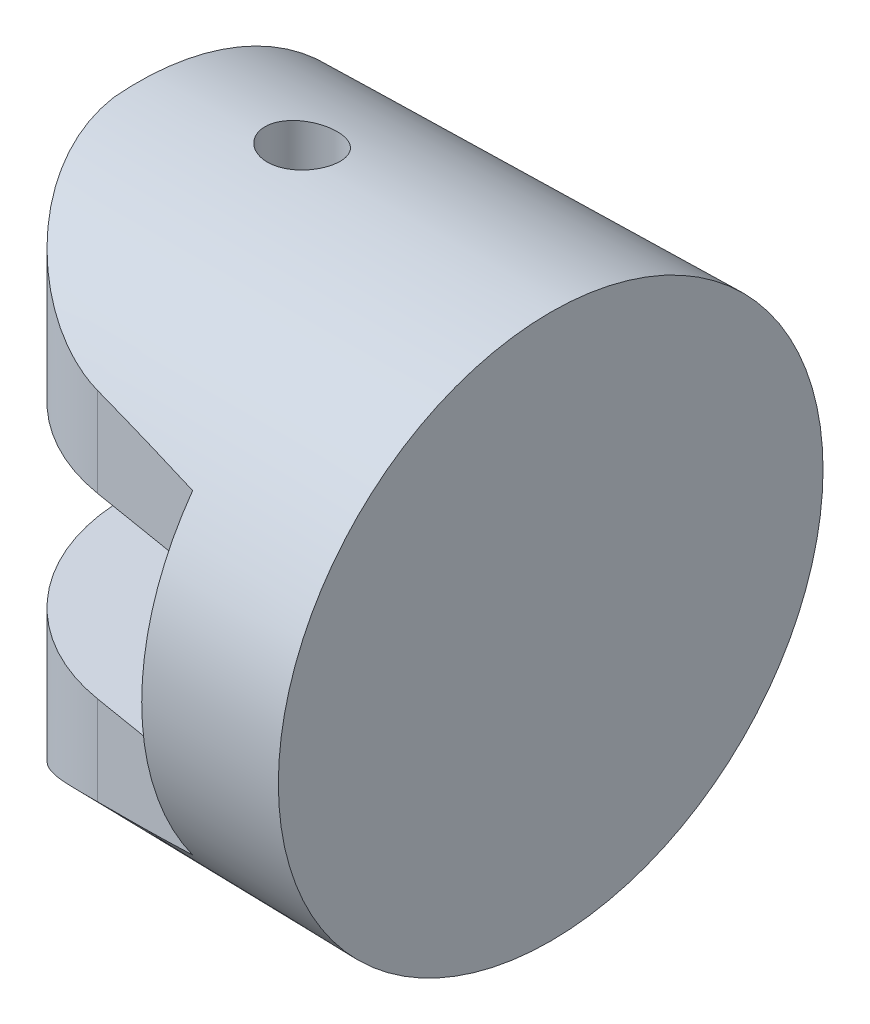
ISO-10303-21;
HEADER;
FILE_DESCRIPTION(('STEP AP214'),'2;1');
FILE_NAME('part.step','',(''),(''),'','','');
FILE_SCHEMA(('AUTOMOTIVE_DESIGN { 1 0 10303 214 1 1 1 1 }'));
ENDSEC;
DATA;
#1=APPLICATION_CONTEXT('core data for automotive mechanical design processes');
#2=APPLICATION_PROTOCOL_DEFINITION('international standard','automotive_design',2000,#1);
#3=PRODUCT_CONTEXT('',#1,'mechanical');
#4=PRODUCT('Part','Part','',(#3));
#5=PRODUCT_RELATED_PRODUCT_CATEGORY('part','',(#4));
#6=PRODUCT_DEFINITION_FORMATION('','',#4);
#7=PRODUCT_DEFINITION_CONTEXT('part definition',#1,'design');
#8=PRODUCT_DEFINITION('design','',#6,#7);
#9=PRODUCT_DEFINITION_SHAPE('','',#8);
#10=(LENGTH_UNIT() NAMED_UNIT(*) SI_UNIT(.MILLI.,.METRE.));
#11=(NAMED_UNIT(*) PLANE_ANGLE_UNIT() SI_UNIT($,.RADIAN.));
#12=(NAMED_UNIT(*) SI_UNIT($,.STERADIAN.) SOLID_ANGLE_UNIT());
#13=UNCERTAINTY_MEASURE_WITH_UNIT(LENGTH_MEASURE(1.E-05),#10,'distance_accuracy_value','');
#14=(GEOMETRIC_REPRESENTATION_CONTEXT(3) GLOBAL_UNCERTAINTY_ASSIGNED_CONTEXT((#13)) GLOBAL_UNIT_ASSIGNED_CONTEXT((#10,
#11,#12)) REPRESENTATION_CONTEXT('',''));
#15=CARTESIAN_POINT('',(0.,0.,0.));
#16=DIRECTION('',(0.,0.,1.));
#17=DIRECTION('',(1.,0.,0.));
#18=AXIS2_PLACEMENT_3D('',#15,#16,#17);
#19=CARTESIAN_POINT('',(18.,0.,0.));
#20=DIRECTION('',(1.,0.,0.));
#21=DIRECTION('',(0.,0.,-1.));
#22=AXIS2_PLACEMENT_3D('',#19,#20,#21);
#23=CONICAL_SURFACE('',#22,10.,0.0174532925199433);
#24=CARTESIAN_POINT('',(11.0177651568953,0.,0.));
#25=DIRECTION('',(1.,0.,0.));
#26=DIRECTION('',(0.,0.,-1.));
#27=AXIS2_PLACEMENT_3D('',#24,#25,#26);
#28=CIRCLE('',#27,9.87812463746955);
#29=CARTESIAN_POINT('',(11.0177651568953,-3.92878497820579,-9.06322210631558));
#30=VERTEX_POINT('',#29);
#31=CARTESIAN_POINT('',(11.0177651568953,3.92878497820579,-9.06322210631558));
#32=VERTEX_POINT('',#31);
#33=EDGE_CURVE('E271',#30,#32,#28,.T.);
#34=ORIENTED_EDGE('',*,*,#33,.T.);
#35=CARTESIAN_POINT('',(20.2969723303004,4.31989451118412,-9.06322210631558));
#36=CARTESIAN_POINT('',(18.7080885564402,4.25543102840023,-9.06322210631558));
#37=CARTESIAN_POINT('',(17.1192523911536,4.18980862170796,-9.06322210631558));
#38=CARTESIAN_POINT('',(13.9416943097065,4.05585646983265,-9.06322210631558));
#39=CARTESIAN_POINT('',(12.3529723935455,3.98752672466418,-9.06322210631558));
#40=CARTESIAN_POINT('',(7.58713330280682,3.77789782009088,-9.06322210631558));
#41=CARTESIAN_POINT('',(4.4102160029855,3.6319539101051,-9.06322210631558));
#42=CARTESIAN_POINT('',(-0.354564542941831,3.39973561718179,-9.06322210631558));
#43=CARTESIAN_POINT('',(-1.94275188567311,3.32011101408796,-9.06322210631558));
#44=CARTESIAN_POINT('',(-5.11883447902559,3.15532531464605,-9.06322210631558));
#45=CARTESIAN_POINT('',(-6.70672973075484,3.07016423975371,-9.06322210631558));
#46=CARTESIAN_POINT('',(-9.88219304506763,2.89279787770695,-9.06322210631558));
#47=CARTESIAN_POINT('',(-11.4697610924561,2.80059231565376,-9.06322210631558));
#48=CARTESIAN_POINT('',(-13.8506918956231,2.65520693731331,-9.06322210631558));
#49=CARTESIAN_POINT('',(-14.6442704742863,2.60556529083735,-9.06322210631558));
#50=CARTESIAN_POINT('',(-16.2312477290328,2.50344514246502,-9.06322210631558));
#51=CARTESIAN_POINT('',(-17.0246464044434,2.45096663013025,-9.06322210631558));
#52=CARTESIAN_POINT('',(-17.8179341999841,2.39683086826783,-9.06322210631558));
#53=B_SPLINE_CURVE_WITH_KNOTS('',3,(#35,#36,#37,#38,#39,#40,#41,#42,#43,#44,#45,#46,#47,#48,#49,
#50,#51,#52),.UNSPECIFIED.,.F.,.F.,(4,2,2,2,2,2,2,2,4),(0.,4.77057082371856,9.54114162178145,
19.0819025653042,23.8524416364401,28.6229622212003,33.3936690623478,35.7790536857637,
38.1644470869158),.UNSPECIFIED.);
#54=CARTESIAN_POINT('',(0.500000000000001,3.44122657780387,-9.06322210631558));
#55=VERTEX_POINT('',#54);
#56=EDGE_CURVE('E66',#32,#55,#53,.T.);
#57=ORIENTED_EDGE('',*,*,#56,.T.);
#58=CARTESIAN_POINT('',(0.5,3.44122657780387,-9.06322210631558));
#59=CARTESIAN_POINT('',(0.488972489827907,3.44064910843317,-9.06323484747074));
#60=CARTESIAN_POINT('',(0.477931357303025,3.44110061300837,-9.06285786392514));
#61=CARTESIAN_POINT('',(0.4562618936079,3.4438246103192,-9.06141879058935));
#62=CARTESIAN_POINT('',(0.445630070497123,3.4460734774454,-9.06036562404899));
#63=CARTESIAN_POINT('',(0.422602189733876,3.45283171405578,-9.05736225179888));
#64=CARTESIAN_POINT('',(0.410343513345188,3.45773422337728,-9.05526407978749));
#65=CARTESIAN_POINT('',(0.386805071862961,3.46932512198919,-9.05038966538554));
#66=CARTESIAN_POINT('',(0.37553073314102,3.47602267243875,-9.04760995106007));
#67=CARTESIAN_POINT('',(0.346852053778633,3.49554320194998,-9.03955531211863));
#68=CARTESIAN_POINT('',(0.330341095440965,3.50948276595441,-9.0338481720886));
#69=CARTESIAN_POINT('',(0.299621432152494,3.53934978995462,-9.0216128697625));
#70=CARTESIAN_POINT('',(0.285418234456481,3.55528184919153,-9.01508280765378));
#71=CARTESIAN_POINT('',(0.257652543224867,3.58982368895958,-9.00086540877679));
#72=CARTESIAN_POINT('',(0.244258070011103,3.6085456605633,-8.99312679824922));
#73=CARTESIAN_POINT('',(0.21916152774292,3.64690648223025,-8.97716661282243));
#74=CARTESIAN_POINT('',(0.207461420613685,3.66654636090242,-8.96894449330291));
#75=CARTESIAN_POINT('',(0.174373351641166,3.72644937730157,-8.94367439726255));
#76=CARTESIAN_POINT('',(0.155058524103321,3.76761298909578,-8.92605654201362));
#77=CARTESIAN_POINT('',(0.117878853864184,3.85737016724907,-8.88696828495656));
#78=CARTESIAN_POINT('',(0.10067257913814,3.90614761858275,-8.86531769684839));
#79=CARTESIAN_POINT('',(0.0705793900740989,4.00450698464848,-8.82074843971116));
#80=CARTESIAN_POINT('',(0.0576976521769212,4.05408978951802,-8.79782828896725));
#81=CARTESIAN_POINT('',(0.0358429898819124,4.15350740429995,-8.75090899216327));
#82=CARTESIAN_POINT('',(0.0268647491596888,4.20334177736191,-8.72691136305049));
#83=CARTESIAN_POINT('',(0.012662204405409,4.30304639931846,-8.6779058509269));
#84=CARTESIAN_POINT('',(0.00743735214440568,4.35291664190827,-8.6528981160184));
#85=CARTESIAN_POINT('',(0.00277353438660693,4.423322702343,-8.61687795639255));
#86=CARTESIAN_POINT('',(0.00173790354349333,4.44395201825318,-8.60623670335064));
#87=CARTESIAN_POINT('',(0.00035213860226231,4.48511862421795,-8.58482730544618));
#88=CARTESIAN_POINT('',(7.25974744487177E-07,4.50565601422816,-8.57405943514926));
#89=CARTESIAN_POINT('',(0.,4.5261595060541,-8.56322210631558));
#90=B_SPLINE_CURVE_WITH_KNOTS('',3,(#58,#59,#60,#61,#62,#63,#64,#65,#66,#67,#68,#69,#70,#71,#72,
#73,#74,#75,#76,#77,#78,#79,#80,#81,#82,#83,#84,#85,#86,#87,#88,#89),.UNSPECIFIED.,.F.,.F.,(4,2,
2,2,2,2,2,2,2,2,2,2,2,2,2,4),(0.,0.0330153300110685,0.0656036862743701,0.105482124639468,
0.145568095171378,0.21223889679795,0.279066536662061,0.35181001144263,0.424637054519927,
0.57061327174187,0.738616317391868,0.906819750414755,1.07479337751626,1.2427424649945,
1.31243961919626,1.38200641190874),.UNSPECIFIED.);
#91=CARTESIAN_POINT('',(0.,4.5261595060541,-8.56322210631558));
#92=VERTEX_POINT('',#91);
#93=EDGE_CURVE('E238',#55,#92,#90,.T.);
#94=ORIENTED_EDGE('',*,*,#93,.T.);
#95=CARTESIAN_POINT('',(0.,0.,0.));
#96=DIRECTION('',(1.,0.,0.));
#97=DIRECTION('',(0.,0.,-1.));
#98=AXIS2_PLACEMENT_3D('',#95,#96,#97);
#99=CIRCLE('',#98,9.68580883129208);
#100=CARTESIAN_POINT('',(0.,9.64535449468622,0.884324255107802));
#101=VERTEX_POINT('',#100);
#102=EDGE_CURVE('E304',#92,#101,#99,.T.);
#103=ORIENTED_EDGE('',*,*,#102,.T.);
#104=CARTESIAN_POINT('',(-1.36975409478247E-05,9.64537258929262,0.884124255107814));
#105=CARTESIAN_POINT('',(0.0123868923697063,9.62898345502771,1.0657605480332));
#106=CARTESIAN_POINT('',(0.0319097094958452,9.6075541672637,1.24640129617914));
#107=CARTESIAN_POINT('',(0.0845881608132044,9.55524357914047,1.60413224665397));
#108=CARTESIAN_POINT('',(0.117731425064306,9.52437086168804,1.78122551811));
#109=CARTESIAN_POINT('',(0.196770459181363,9.45403081721556,2.12934455143109));
#110=CARTESIAN_POINT('',(0.242570125942704,9.41462872596965,2.3004054943183));
#111=CARTESIAN_POINT('',(0.346287823946465,9.32789684979715,2.63676332814577));
#112=CARTESIAN_POINT('',(0.404208193858568,9.28056553529206,2.80205909951436));
#113=CARTESIAN_POINT('',(0.531139407846054,9.17906407232717,3.12537340116261));
#114=CARTESIAN_POINT('',(0.600107850186022,9.124920233813,3.28341689555175));
#115=CARTESIAN_POINT('',(0.748521366783366,9.0106000413984,3.59226932860706));
#116=CARTESIAN_POINT('',(0.827970498318087,8.95042135346575,3.74307543454829));
#117=CARTESIAN_POINT('',(1.08114581746759,8.76213953492645,4.18424721990012));
#118=CARTESIAN_POINT('',(1.26957479609656,8.62639216554954,4.46305274627942));
#119=CARTESIAN_POINT('',(1.70599105772172,8.32510973623837,5.01969391646392));
#120=CARTESIAN_POINT('',(1.95846577192259,8.15796809899323,5.2931251913958));
#121=CARTESIAN_POINT('',(2.36612117644174,7.90494604271217,5.67023362747837));
#122=CARTESIAN_POINT('',(2.50697950417843,7.82013782119801,5.79052968044107));
#123=CARTESIAN_POINT('',(2.79812127913359,7.651491295814,6.01982577214195));
#124=CARTESIAN_POINT('',(2.94840138096449,7.56765266005769,6.12882978428737));
#125=CARTESIAN_POINT('',(3.24251970729209,7.41124406850702,6.3247154473614));
#126=CARTESIAN_POINT('',(3.38546014785115,7.33839488440852,6.41271952841057));
#127=CARTESIAN_POINT('',(3.67875378713234,7.19668152216184,6.57895529352384));
#128=CARTESIAN_POINT('',(3.82910794964942,7.12781786468103,6.65718570229969));
#129=CARTESIAN_POINT('',(4.29016397688817,6.93047449281161,6.87589081226343));
#130=CARTESIAN_POINT('',(4.61227358236053,6.81045383364741,7.00133102900793));
#131=CARTESIAN_POINT('',(5.09174236835255,6.66836677207874,7.14711198266969));
#132=CARTESIAN_POINT('',(5.23851371880068,6.62943088747617,7.18663340659563));
#133=CARTESIAN_POINT('',(5.53671146625283,6.56066036848477,7.25647405178247));
#134=CARTESIAN_POINT('',(5.68814874719265,6.53084911918732,7.28676962756826));
#135=CARTESIAN_POINT('',(5.84145886876603,6.50641172742482,7.31211903025766));
#136=B_SPLINE_CURVE_WITH_KNOTS('',3,(#104,#105,#106,#107,#108,#109,#110,#111,#112,#113,#114,
#115,#116,#117,#118,#119,#120,#121,#122,#123,#124,#125,#126,#127,#128,#129,#130,#131,#132,#133,
#134,#135),.UNSPECIFIED.,.F.,.F.,(4,2,2,2,2,2,2,2,2,2,2,2,2,2,2,4),(0.,0.548099498363084,
1.0957023150084,1.6392561938557,2.18291504738781,2.72453527682406,3.26636579661093,
4.35107355933018,5.57024159975679,6.18100046028574,6.79154367367793,7.34003028043755,
7.88858838024264,8.98011661667429,9.45032579876322,9.92173015747335),.UNSPECIFIED.);
#137=CARTESIAN_POINT('',(5.84125886876603,6.50644365183281,7.31208595043073));
#138=VERTEX_POINT('',#137);
#139=EDGE_CURVE('E228',#101,#138,#136,.T.);
#140=ORIENTED_EDGE('',*,*,#139,.T.);
#141=CARTESIAN_POINT('',(-32.5469915710701,0.,0.962131485217023));
#142=DIRECTION('',(-0.163196404380119,0.,0.986593601032056));
#143=DIRECTION('',(0.986593601032056,0.,0.163196404380119));
#144=AXIS2_PLACEMENT_3D('',#141,#142,#143);
#145=ELLIPSE('',#144,55.8694844707714,9.06679313201254);
#146=CARTESIAN_POINT('',(10.,5.76425963035589,8.));
#147=VERTEX_POINT('',#146);
#148=EDGE_CURVE('E298',#147,#138,#145,.T.);
#149=ORIENTED_EDGE('',*,*,#148,.F.);
#150=CARTESIAN_POINT('',(10.,0.,0.));
#151=DIRECTION('',(1.,0.,0.));
#152=DIRECTION('',(0.,0.,-1.));
#153=AXIS2_PLACEMENT_3D('',#150,#151,#152);
#154=CIRCLE('',#153,9.86035948057426);
#155=CARTESIAN_POINT('',(10.,-5.76425963035589,8.));
#156=VERTEX_POINT('',#155);
#157=EDGE_CURVE('E290',#147,#156,#154,.T.);
#158=ORIENTED_EDGE('',*,*,#157,.T.);
#159=CARTESIAN_POINT('',(5.84125886876603,-6.50644365183283,7.31208595043073));
#160=VERTEX_POINT('',#159);
#161=EDGE_CURVE('E187',#160,#156,#145,.T.);
#162=ORIENTED_EDGE('',*,*,#161,.F.);
#163=CARTESIAN_POINT('',(5.84145886876603,-6.50641172742482,7.31211903025766));
#164=CARTESIAN_POINT('',(5.65545507837015,-6.53603876221126,7.28138107725543));
#165=CARTESIAN_POINT('',(5.47219254414434,-6.57360969084854,7.24333168314501));
#166=CARTESIAN_POINT('',(5.11271525289329,-6.66173818234046,7.15380287186));
#167=CARTESIAN_POINT('',(4.93648237925481,-6.71225948300966,7.10236094876064));
#168=CARTESIAN_POINT('',(4.59298202137957,-6.8231323974145,6.98752395262283));
#169=CARTESIAN_POINT('',(4.42565355972415,-6.88340120956597,6.9242289087127));
#170=CARTESIAN_POINT('',(4.09873651313887,-7.01150535897184,6.78627926691875));
#171=CARTESIAN_POINT('',(3.9391504312696,-7.07934312013544,6.71162102723833));
#172=CARTESIAN_POINT('',(3.59360092776935,-7.23585653152373,6.53400476786316));
#173=CARTESIAN_POINT('',(3.40956903497781,-7.32583099368512,6.42843535646395));
#174=CARTESIAN_POINT('',(3.0533917744159,-7.51020366867256,6.20228320734757));
#175=CARTESIAN_POINT('',(2.88124643149187,-7.60460189074485,6.08170043824959));
#176=CARTESIAN_POINT('',(2.54816965404073,-7.7954115890666,5.82543463440269));
#177=CARTESIAN_POINT('',(2.38729735029819,-7.89183066792734,5.68968045022658));
#178=CARTESIAN_POINT('',(2.07810223885349,-8.08368471916481,5.40393711809305));
#179=CARTESIAN_POINT('',(1.92977901048627,-8.17911972443501,5.25394844765625));
#180=CARTESIAN_POINT('',(1.6451337013013,-8.36751707462208,4.9386895136001));
#181=CARTESIAN_POINT('',(1.50892595221698,-8.46045105334288,4.7732987889067));
#182=CARTESIAN_POINT('',(1.25096355230605,-8.64075431087674,4.42871649421447));
#183=CARTESIAN_POINT('',(1.12920994624197,-8.72812318722635,4.24952392814385));
#184=CARTESIAN_POINT('',(0.902062226783428,-8.8946832665904,3.87889544043039));
#185=CARTESIAN_POINT('',(0.796587571255013,-8.97391403606837,3.68752687725624));
#186=CARTESIAN_POINT('',(0.602804245557033,-9.1225833932279,3.29268150137494));
#187=CARTESIAN_POINT('',(0.51448967609839,-9.19202534384474,3.0892088813287));
#188=CARTESIAN_POINT('',(0.376602421652433,-9.30305993663332,2.72433306514314));
#189=CARTESIAN_POINT('',(0.322877887306207,-9.34725733020708,2.56527865068239));
#190=CARTESIAN_POINT('',(0.226624990050696,-9.42828686177948,2.24202965081413));
#191=CARTESIAN_POINT('',(0.184092504652002,-9.46512171049926,2.0778369830409));
#192=CARTESIAN_POINT('',(0.110539072359541,-9.53102473043131,1.74384694638878));
#193=CARTESIAN_POINT('',(0.0796178680059476,-9.56002503194743,1.57401407309212));
#194=CARTESIAN_POINT('',(0.0302756948642142,-9.60935256830463,1.23113380310959));
#195=CARTESIAN_POINT('',(0.0118669969298597,-9.62967128199486,1.05808342138005));
#196=CARTESIAN_POINT('',(-1.36975409472117E-05,-9.64537258929262,0.884124255107814));
#197=B_SPLINE_CURVE_WITH_KNOTS('',3,(#163,#164,#165,#166,#167,#168,#169,#170,#171,#172,#173,
#174,#175,#176,#177,#178,#179,#180,#181,#182,#183,#184,#185,#186,#187,#188,#189,#190,#191,#192,
#193,#194,#195,#196),.UNSPECIFIED.,.F.,.F.,(4,2,2,2,2,2,2,2,2,2,2,2,2,2,2,2,4),(0.,
0.571822725121285,1.14206146096066,1.70768868840184,2.27349757721802,2.96392081226091,
3.65434549044501,4.3481558944485,5.04194303159614,5.74170397822399,6.44151547364363,
7.1377451738392,7.83373509927868,8.35400293838512,8.87407887246403,9.39852533836108,
9.9234853829405),.UNSPECIFIED.);
#198=CARTESIAN_POINT('',(0.,-9.64535449468622,0.884324255107802));
#199=VERTEX_POINT('',#198);
#200=EDGE_CURVE('E180',#160,#199,#197,.T.);
#201=ORIENTED_EDGE('',*,*,#200,.T.);
#202=CARTESIAN_POINT('',(0.,-4.5261595060541,-8.56322210631558));
#203=VERTEX_POINT('',#202);
#204=EDGE_CURVE('E299',#199,#203,#99,.T.);
#205=ORIENTED_EDGE('',*,*,#204,.T.);
#206=CARTESIAN_POINT('',(0.,-4.5261595060541,-8.56322210631558));
#207=CARTESIAN_POINT('',(3.52078323917884E-06,-4.49689838645403,-8.57868858436406));
#208=CARTESIAN_POINT('',(0.000717079108537124,-4.46756935573359,-8.59401260241704));
#209=CARTESIAN_POINT('',(0.00351679653573565,-4.40881881293596,-8.62435454359161));
#210=CARTESIAN_POINT('',(0.0056029354608865,-4.37939730222453,-8.63937247120935));
#211=CARTESIAN_POINT('',(0.0138696466206229,-4.29083707640125,-8.68404736133356));
#212=CARTESIAN_POINT('',(0.0220578126531436,-4.23162260551151,-8.71320919509503));
#213=CARTESIAN_POINT('',(0.0437448116036034,-4.11354137842965,-8.76999160790625));
#214=CARTESIAN_POINT('',(0.0572364296467087,-4.0546742596669,-8.7976142228802));
#215=CARTESIAN_POINT('',(0.0900100035563004,-3.93785404065863,-8.85114342829085));
#216=CARTESIAN_POINT('',(0.109280408136579,-3.87989935753482,-8.87705331738044));
#217=CARTESIAN_POINT('',(0.142560653606728,-3.79726177007297,-8.9131756104814));
#218=CARTESIAN_POINT('',(0.153661919385446,-3.77175831739041,-8.9242058813395));
#219=CARTESIAN_POINT('',(0.177685950924785,-3.72131071212216,-8.94581370518517));
#220=CARTESIAN_POINT('',(0.190613674145874,-3.69636830332269,-8.95638992036121));
#221=CARTESIAN_POINT('',(0.220575416310808,-3.64417477449348,-8.97832880532304));
#222=CARTESIAN_POINT('',(0.237928427418449,-3.61706837030029,-8.98960404591289));
#223=CARTESIAN_POINT('',(0.276449756575891,-3.56523157079576,-9.01100915202635));
#224=CARTESIAN_POINT('',(0.297598452704398,-3.54048991425656,-9.02114449141271));
#225=CARTESIAN_POINT('',(0.331261397350281,-3.50910657949312,-9.03400290543964));
#226=CARTESIAN_POINT('',(0.341504986975262,-3.50040060735315,-9.03757023465756));
#227=CARTESIAN_POINT('',(0.363071607485699,-3.48417718895185,-9.04424040760721));
#228=CARTESIAN_POINT('',(0.374395716099887,-3.47666094963887,-9.04734277948617));
#229=CARTESIAN_POINT('',(0.398372513727722,-3.4632262719665,-9.05294215812881));
#230=CARTESIAN_POINT('',(0.411043654147467,-3.45733549996704,-9.05542861684756));
#231=CARTESIAN_POINT('',(0.437389825477064,-3.44804431284383,-9.05946266813466));
#232=CARTESIAN_POINT('',(0.451059356899083,-3.44463124279693,-9.06101502458788));
#233=CARTESIAN_POINT('',(0.47074321049364,-3.4419541419711,-9.06239958386088));
#234=CARTESIAN_POINT('',(0.476568496130586,-3.44143116747288,-9.0627069426259));
#235=CARTESIAN_POINT('',(0.488265566865585,-3.44092172747637,-9.06311875734952));
#236=CARTESIAN_POINT('',(0.494137435779181,-3.44093674117421,-9.06322265306116));
#237=CARTESIAN_POINT('',(0.500000000000008,-3.44122657780394,-9.06322210631559));
#238=B_SPLINE_CURVE_WITH_KNOTS('',3,(#206,#207,#208,#209,#210,#211,#212,#213,#214,#215,#216,
#217,#218,#219,#220,#221,#222,#223,#224,#225,#226,#227,#228,#229,#230,#231,#232,#233,#234,#235,
#236,#237),.UNSPECIFIED.,.F.,.F.,(4,2,2,2,2,2,2,2,2,2,2,2,2,2,2,4),(0.,0.099271856744869,
0.198542254239432,0.397827037742288,0.596841645089762,0.795461061813636,0.885182148331654,
0.97515161363072,1.07730379781432,1.17894236439359,1.22059474022493,1.2622891040147,
1.30465459930614,1.34680215948835,1.36434770634063,1.38194149828717),.UNSPECIFIED.);
#239=CARTESIAN_POINT('',(0.500000000000001,-3.44122657780388,-9.06322210631558));
#240=VERTEX_POINT('',#239);
#241=EDGE_CURVE('E242',#203,#240,#238,.T.);
#242=ORIENTED_EDGE('',*,*,#241,.T.);
#243=CARTESIAN_POINT('',(-17.8179341999841,-2.39683086826783,-9.06322210631558));
#244=CARTESIAN_POINT('',(-17.0246464044434,-2.45096663013026,-9.06322210631558));
#245=CARTESIAN_POINT('',(-16.2312477290328,-2.50344514246502,-9.06322210631558));
#246=CARTESIAN_POINT('',(-14.6442704742863,-2.60556529083735,-9.06322210631558));
#247=CARTESIAN_POINT('',(-13.8506918956231,-2.6552069373133,-9.06322210631558));
#248=CARTESIAN_POINT('',(-11.4697610924561,-2.80059231565379,-9.06322210631558));
#249=CARTESIAN_POINT('',(-9.88219304506764,-2.89279787770707,-9.06322210631558));
#250=CARTESIAN_POINT('',(-6.70672973075485,-3.07016423975361,-9.06322210631558));
#251=CARTESIAN_POINT('',(-5.11883447902559,-3.15532531464564,-9.06322210631558));
#252=CARTESIAN_POINT('',(-1.94275188567315,-3.32011101408837,-9.06322210631558));
#253=CARTESIAN_POINT('',(-0.354564542941935,-3.39973561718333,-9.06322210631558));
#254=CARTESIAN_POINT('',(4.41021600298533,-3.6319539101078,-9.06322210631558));
#255=CARTESIAN_POINT('',(7.58713330280677,-3.77789782009142,-9.06322210631558));
#256=CARTESIAN_POINT('',(12.3529723935455,-3.98752672466391,-9.06322210631558));
#257=CARTESIAN_POINT('',(13.9416943097065,-4.05585646983251,-9.06322210631558));
#258=CARTESIAN_POINT('',(17.1192523911536,-4.18980862170809,-9.06322210631558));
#259=CARTESIAN_POINT('',(18.7080885564402,-4.2554310284005,-9.06322210631558));
#260=CARTESIAN_POINT('',(20.2969723303004,-4.31989451118412,-9.06322210631558));
#261=B_SPLINE_CURVE_WITH_KNOTS('',3,(#243,#244,#245,#246,#247,#248,#249,#250,#251,#252,#253,
#254,#255,#256,#257,#258,#259,#260),.UNSPECIFIED.,.F.,.F.,(4,2,2,2,2,2,2,2,4),(0.,
2.38539340115203,4.77077802456795,9.54148486571546,14.3120054504757,19.0825445216115,
28.6233054651343,33.3938762631972,38.1644470869158),.UNSPECIFIED.);
#262=EDGE_CURVE('E221',#240,#30,#261,.T.);
#263=ORIENTED_EDGE('',*,*,#262,.T.);
#264=EDGE_LOOP('',(#34,#57,#94,#103,#140,#149,#158,#162,#201,#205,#242,#263));
#265=FACE_BOUND('',#264,.T.);
#266=CARTESIAN_POINT('',(4.13346945761658,9.57101514208139,-1.90090222505924));
#267=CARTESIAN_POINT('',(4.18342600591672,9.56236152374585,-1.94894948853613));
#268=CARTESIAN_POINT('',(4.23746026321015,9.55421901800578,-1.99290459291782));
#269=CARTESIAN_POINT('',(4.3522651237963,9.53957224125092,-2.07134479220033));
#270=CARTESIAN_POINT('',(4.41304119613739,9.53306931448678,-2.10582211858084));
#271=CARTESIAN_POINT('',(4.53969359272767,9.52224195243703,-2.16425179575432));
#272=CARTESIAN_POINT('',(4.6055728190464,9.51791876737952,-2.18819810529894));
#273=CARTESIAN_POINT('',(4.74050336712271,9.51185750485479,-2.22476348707766));
#274=CARTESIAN_POINT('',(4.80955381820616,9.51011872215077,-2.23738564909457));
#275=CARTESIAN_POINT('',(4.947721503668,9.50943030413032,-2.25080363263012));
#276=CARTESIAN_POINT('',(5.01682101181709,9.51043772891321,-2.25178025610966));
#277=CARTESIAN_POINT('',(5.15414747643948,9.51512424282467,-2.24236684781743));
#278=CARTESIAN_POINT('',(5.22237443416098,9.51880332813093,-2.23197683230766));
#279=CARTESIAN_POINT('',(5.35572074418967,9.52857150547558,-2.20026617668595));
#280=CARTESIAN_POINT('',(5.42085282982589,9.53464954973138,-2.1789955134743));
#281=CARTESIAN_POINT('',(5.54659601857615,9.54880408941442,-2.12622524080879));
#282=CARTESIAN_POINT('',(5.6072066929241,9.55688077406029,-2.09472466276314));
#283=CARTESIAN_POINT('',(5.72346021059363,9.5746673224026,-2.02171746875441));
#284=CARTESIAN_POINT('',(5.77898519924078,9.58440558910029,-1.98003019396643));
#285=CARTESIAN_POINT('',(5.88230424393567,9.60476513504891,-1.88815539274688));
#286=CARTESIAN_POINT('',(5.9300972374861,9.61538653535315,-1.8379667000237));
#287=CARTESIAN_POINT('',(6.01774836893052,9.63710833869204,-1.72916445335651));
#288=CARTESIAN_POINT('',(6.05739509940271,9.64821413529513,-1.67038150060759));
#289=CARTESIAN_POINT('',(6.12622900267999,9.66999576841283,-1.54690473559188));
#290=CARTESIAN_POINT('',(6.1554157186609,9.68067158613073,-1.48221066532141));
#291=CARTESIAN_POINT('',(6.20259328085243,9.70105828257676,-1.34832752307853));
#292=CARTESIAN_POINT('',(6.22052560067628,9.71076389997219,-1.27911698654509));
#293=CARTESIAN_POINT('',(6.24435285811495,9.7286748750329,-1.13846436313944));
#294=CARTESIAN_POINT('',(6.250248785203,9.7368803559691,-1.06702246019098));
#295=CARTESIAN_POINT('',(6.24973856706113,9.75138457782993,-0.924966558342467));
#296=CARTESIAN_POINT('',(6.24349809884852,9.75770765775182,-0.85435446432077));
#297=CARTESIAN_POINT('',(6.21914237952359,9.76847680941686,-0.71506235617091));
#298=CARTESIAN_POINT('',(6.20102811617614,9.77292303724223,-0.646382181824575));
#299=CARTESIAN_POINT('',(6.15374107107692,9.77994996613092,-0.513937492196695));
#300=CARTESIAN_POINT('',(6.12472768882629,9.78255606807839,-0.450117353112185));
#301=CARTESIAN_POINT('',(6.05643081323688,9.78621307854603,-0.328183997922447));
#302=CARTESIAN_POINT('',(6.01714745326043,9.78726400725995,-0.270070707723569));
#303=CARTESIAN_POINT('',(5.9295246520237,9.78813033226344,-0.161341475731994));
#304=CARTESIAN_POINT('',(5.88120613298156,9.787948549451,-0.110708687155894));
#305=CARTESIAN_POINT('',(5.77681517451336,9.78673614338498,-0.0182046382330826));
#306=CARTESIAN_POINT('',(5.72074252950747,9.78570549762249,0.023666389745075));
#307=CARTESIAN_POINT('',(5.60211620073801,9.78317726729913,0.0976645370688435));
#308=CARTESIAN_POINT('',(5.5395314229478,9.78167736681791,0.129741734458079));
#309=CARTESIAN_POINT('',(5.40987779782902,9.77856347237818,0.182967095357986));
#310=CARTESIAN_POINT('',(5.34280888649254,9.77694947679101,0.204115102824421));
#311=CARTESIAN_POINT('',(5.20586419277929,9.77386677058813,0.234933460971755));
#312=CARTESIAN_POINT('',(5.13598046553774,9.77239851861156,0.244568570228824));
#313=CARTESIAN_POINT('',(4.99558186270751,9.76975913762485,0.251967300490288));
#314=CARTESIAN_POINT('',(4.92506698745283,9.7685880084575,0.249730927776686));
#315=CARTESIAN_POINT('',(4.78542654690018,9.76655238716461,0.233449695264527));
#316=CARTESIAN_POINT('',(4.71630065268976,9.76568782161758,0.219407665621522));
#317=CARTESIAN_POINT('',(4.58138567147438,9.76413952230282,0.179916301818938));
#318=CARTESIAN_POINT('',(4.51559659864872,9.76345578930345,0.154466919190101));
#319=CARTESIAN_POINT('',(4.38922930809985,9.76202949539836,0.0928856800892488));
#320=CARTESIAN_POINT('',(4.32865079368163,9.7612869378468,0.0567544323750544));
#321=CARTESIAN_POINT('',(4.21442284680852,9.75942506616462,-0.0251625484166847));
#322=CARTESIAN_POINT('',(4.16077340982933,9.75830575228,-0.0709482751903446));
#323=CARTESIAN_POINT('',(4.06194615457423,9.75534198500791,-0.170849730225446));
#324=CARTESIAN_POINT('',(4.01676575884642,9.75349775277161,-0.224962914964837));
#325=CARTESIAN_POINT('',(3.93614216329143,9.74875774800991,-0.339971224259014));
#326=CARTESIAN_POINT('',(3.9006987370335,9.74586199994089,-0.400866191058891));
#327=CARTESIAN_POINT('',(3.84061309753321,9.7387752248957,-0.527533232512144));
#328=CARTESIAN_POINT('',(3.81594701168856,9.73458709614003,-0.593294146697785));
#329=CARTESIAN_POINT('',(3.77796955804274,9.72478245425931,-0.727910945690833));
#330=CARTESIAN_POINT('',(3.76465772541774,9.7191659996197,-0.796766703679096));
#331=CARTESIAN_POINT('',(3.74970709253085,9.706521215929,-0.935618382359388));
#332=CARTESIAN_POINT('',(3.74807078232488,9.6994925860298,-1.00561454307664));
#333=CARTESIAN_POINT('',(3.75645718303604,9.68420098171622,-1.14478267986478));
#334=CARTESIAN_POINT('',(3.76648278357297,9.67593770181918,-1.21395444737413));
#335=CARTESIAN_POINT('',(3.79799089574123,9.65843522236326,-1.35014832824286));
#336=CARTESIAN_POINT('',(3.8195726000213,9.64918813737256,-1.41714642182028));
#337=CARTESIAN_POINT('',(3.87360928489195,9.63025979779766,-1.54648742650093));
#338=CARTESIAN_POINT('',(3.90605479862177,9.62057892755943,-1.60883433306472));
#339=CARTESIAN_POINT('',(3.97029083242458,9.60408443509386,-1.71043866888133));
#340=CARTESIAN_POINT('',(3.9996685955231,9.597234652634,-1.75123740023331));
#341=CARTESIAN_POINT('',(4.06313881796322,9.5838386446907,-1.82904260114501));
#342=CARTESIAN_POINT('',(4.09723130120101,9.57729242074605,-1.86604905148218));
#343=CARTESIAN_POINT('',(4.13346945761658,9.57101514208139,-1.90090222505924));
#344=B_SPLINE_CURVE_WITH_KNOTS('',3,(#266,#267,#268,#269,#270,#271,#272,#273,#274,#275,#276,
#277,#278,#279,#280,#281,#282,#283,#284,#285,#286,#287,#288,#289,#290,#291,#292,#293,#294,#295,
#296,#297,#298,#299,#300,#301,#302,#303,#304,#305,#306,#307,#308,#309,#310,#311,#312,#313,#314,
#315,#316,#317,#318,#319,#320,#321,#322,#323,#324,#325,#326,#327,#328,#329,#330,#331,#332,#333,
#334,#335,#336,#337,#338,#339,#340,#341,#342,#343),.UNSPECIFIED.,.T.,.F.,(4,2,2,2,2,2,2,2,2,2,2,
2,2,2,2,2,2,2,2,2,2,2,2,2,2,2,2,2,2,2,2,2,2,2,2,2,2,2,4),(0.,0.209372748368325,
0.418916602172946,0.628580507100318,0.838187188018852,1.0445353203254,1.25088315741436,
1.45629159792036,1.66171949264151,1.87109522928226,2.08049971303753,2.29479524819501,
2.50910014122257,2.72451044832044,2.93990304651481,3.15237589634133,3.36483107308285,
3.57429296231086,3.78375213167564,3.99273214332657,4.20171769658412,4.41175137795819,
4.62178805805771,4.83246603481189,5.04314390008211,5.25377127420435,5.46439954327998,
5.67501581099666,5.88563194119203,6.09618386843515,6.30673089893213,6.51680915822992,
6.7268788168679,6.93699327603356,7.14715980902035,7.35915993890947,7.57097580792651,
7.7228526730409,7.87473030795962),.UNSPECIFIED.);
#345=CARTESIAN_POINT('',(4.13346945761658,9.57101514208139,-1.90090222505924));
#346=VERTEX_POINT('',#345);
#347=EDGE_CURVE('E179',#346,#346,#344,.T.);
#348=ORIENTED_EDGE('',*,*,#347,.T.);
#349=EDGE_LOOP('',(#348));
#350=FACE_BOUND('',#349,.T.);
#351=CARTESIAN_POINT('',(4.13346945761658,-9.57101514208139,-1.90090222505924));
#352=CARTESIAN_POINT('',(4.08239679040413,-9.57986317287946,-1.85177415143854));
#353=CARTESIAN_POINT('',(4.03552436470055,-9.58925613081281,-1.79830741154274));
#354=CARTESIAN_POINT('',(3.95148955201702,-9.60846129879568,-1.68421983912996));
#355=CARTESIAN_POINT('',(3.91433901440107,-9.61827400366308,-1.62359040585175));
#356=CARTESIAN_POINT('',(3.85083031046029,-9.63767851450925,-1.49691477340384));
#357=CARTESIAN_POINT('',(3.82446725369385,-9.64727041872129,-1.43087104510964));
#358=CARTESIAN_POINT('',(3.78328951051635,-9.6656949767422,-1.29519527494847));
#359=CARTESIAN_POINT('',(3.76847144717925,-9.67452785189501,-1.22556428871722));
#360=CARTESIAN_POINT('',(3.75086811413788,-9.69101118116788,-1.08479648458762));
#361=CARTESIAN_POINT('',(3.74805941582284,-9.69866390943591,-1.01366287095132));
#362=CARTESIAN_POINT('',(3.75456526002177,-9.71255658827013,-0.871809881843989));
#363=CARTESIAN_POINT('',(3.76387956333538,-9.71879656670861,-0.801090498227387));
#364=CARTESIAN_POINT('',(3.79424765420933,-9.72972210468912,-0.662944985239679));
#365=CARTESIAN_POINT('',(3.81516657755231,-9.73442455281637,-0.595490528283607));
#366=CARTESIAN_POINT('',(3.86808819048375,-9.74245541930124,-0.464992824598504));
#367=CARTESIAN_POINT('',(3.90009047198349,-9.74578388823882,-0.401949415557619));
#368=CARTESIAN_POINT('',(3.97404397261965,-9.7512674093671,-0.282491452365221));
#369=CARTESIAN_POINT('',(4.01593156100551,-9.75342968724281,-0.226037817769032));
#370=CARTESIAN_POINT('',(4.10857886597351,-9.75691700194565,-0.120922902150275));
#371=CARTESIAN_POINT('',(4.15933861996779,-9.75824203524219,-0.0722616539883081));
#372=CARTESIAN_POINT('',(4.26835110226045,-9.76040020674278,0.0159283939786202));
#373=CARTESIAN_POINT('',(4.32661173470769,-9.76123282080128,0.055447435414762));
#374=CARTESIAN_POINT('',(4.44893312651283,-9.76273638630298,0.124164826690121));
#375=CARTESIAN_POINT('',(4.51299393288881,-9.76340733643552,0.153363092856363));
#376=CARTESIAN_POINT('',(4.64522348213308,-9.7648589585008,0.200655194231766));
#377=CARTESIAN_POINT('',(4.71339955824162,-9.76563982981525,0.218728522983019));
#378=CARTESIAN_POINT('',(4.85181448642822,-9.76747870376144,0.243173419225039));
#379=CARTESIAN_POINT('',(4.92205333617987,-9.76853670608064,0.249544999912663));
#380=CARTESIAN_POINT('',(5.06259583651101,-9.77096861253035,0.25040787006422));
#381=CARTESIAN_POINT('',(5.13289948464984,-9.77234250521107,0.244899590066094));
#382=CARTESIAN_POINT('',(5.27158091150738,-9.77530695541725,0.222162551252363));
#383=CARTESIAN_POINT('',(5.33995867252786,-9.77689751493303,0.204933684765263));
#384=CARTESIAN_POINT('',(5.47287452960165,-9.78006853529919,0.159236822209533));
#385=CARTESIAN_POINT('',(5.53741137668788,-9.78164899271711,0.13076519301183));
#386=CARTESIAN_POINT('',(5.66079522727729,-9.78447084951939,0.0633863364441379));
#387=CARTESIAN_POINT('',(5.71964220621798,-9.78571224744011,0.0244790640274321));
#388=CARTESIAN_POINT('',(5.82995965386838,-9.78746722632241,-0.0626599909090666));
#389=CARTESIAN_POINT('',(5.88143213965577,-9.7879810066455,-0.110889215169766));
#390=CARTESIAN_POINT('',(5.97554779564182,-9.78788349755741,-0.215305085255234));
#391=CARTESIAN_POINT('',(6.01819125927636,-9.78727224554379,-0.271491466516326));
#392=CARTESIAN_POINT('',(6.09327150271661,-9.7845779138132,-0.389955176465335));
#393=CARTESIAN_POINT('',(6.12574984611405,-9.78250094375699,-0.452206299793222));
#394=CARTESIAN_POINT('',(6.17982541258126,-9.77663088809703,-0.581189993137083));
#395=CARTESIAN_POINT('',(6.20142308836835,-9.77283787390604,-0.647922376568096));
#396=CARTESIAN_POINT('',(6.2330974357367,-9.76344425952345,-0.783650057215212));
#397=CARTESIAN_POINT('',(6.24322129593479,-9.75785118534798,-0.852634876487777));
#398=CARTESIAN_POINT('',(6.25189405800872,-9.74490682815127,-0.991162144794457));
#399=CARTESIAN_POINT('',(6.25044268983173,-9.73755550411351,-1.0607046068007));
#400=CARTESIAN_POINT('',(6.23605321826339,-9.72127129209361,-1.19879153654444));
#401=CARTESIAN_POINT('',(6.2230517548204,-9.71232989820368,-1.26732837675222));
#402=CARTESIAN_POINT('',(6.18591929134585,-9.69327470423763,-1.40114637893656));
#403=CARTESIAN_POINT('',(6.16178722719012,-9.68316079213393,-1.4664272289677));
#404=CARTESIAN_POINT('',(6.10263979237735,-9.6621063044257,-1.5929931067446));
#405=CARTESIAN_POINT('',(6.06745970627891,-9.65115525345057,-1.65419943086754));
#406=CARTESIAN_POINT('',(5.98732343116648,-9.62919975833471,-1.76983226057526));
#407=CARTESIAN_POINT('',(5.94236632984155,-9.61819530930507,-1.8242581327179));
#408=CARTESIAN_POINT('',(5.843344294545,-9.59670432703296,-1.92538129001476));
#409=CARTESIAN_POINT('',(5.7891877560901,-9.58622453055512,-1.97199041393015));
#410=CARTESIAN_POINT('',(5.67356788777972,-9.56662202830994,-2.05540839400601));
#411=CARTESIAN_POINT('',(5.61210491456021,-9.55749925635347,-2.09221772822225));
#412=CARTESIAN_POINT('',(5.48424838031794,-9.54135013148601,-2.15455996800812));
#413=CARTESIAN_POINT('',(5.41791290690259,-9.53430291291267,-2.18020644070354));
#414=CARTESIAN_POINT('',(5.28165804432389,-9.52269324729756,-2.21991865711647));
#415=CARTESIAN_POINT('',(5.21173940665753,-9.51813028154805,-2.23398681867971));
#416=CARTESIAN_POINT('',(5.07218593989032,-9.51189251024132,-2.24983876852974));
#417=CARTESIAN_POINT('',(5.00258824446494,-9.51014791553248,-2.25192277628448));
#418=CARTESIAN_POINT('',(4.86398437814881,-9.50941335732543,-2.24451411149826));
#419=CARTESIAN_POINT('',(4.79497828063,-9.51042373068807,-2.23502002333616));
#420=CARTESIAN_POINT('',(4.6604845948192,-9.51502854822889,-2.20495540234552));
#421=CARTESIAN_POINT('',(4.59496258966991,-9.518588712536,-2.18453270719012));
#422=CARTESIAN_POINT('',(4.46831750231597,-9.52792587562686,-2.13334473251595));
#423=CARTESIAN_POINT('',(4.40719023963662,-9.53370073365617,-2.10258944417677));
#424=CARTESIAN_POINT('',(4.31018730786977,-9.54478688441965,-2.04342601076004));
#425=CARTESIAN_POINT('',(4.27264818909059,-9.5496194340691,-2.01760777451757));
#426=CARTESIAN_POINT('',(4.20065417958299,-9.55989843341687,-1.96208774310816));
#427=CARTESIAN_POINT('',(4.16619932537903,-9.56534489038347,-1.93238590196103));
#428=CARTESIAN_POINT('',(4.13346945761658,-9.57101514208139,-1.90090222505924));
#429=B_SPLINE_CURVE_WITH_KNOTS('',3,(#351,#352,#353,#354,#355,#356,#357,#358,#359,#360,#361,
#362,#363,#364,#365,#366,#367,#368,#369,#370,#371,#372,#373,#374,#375,#376,#377,#378,#379,#380,
#381,#382,#383,#384,#385,#386,#387,#388,#389,#390,#391,#392,#393,#394,#395,#396,#397,#398,#399,
#400,#401,#402,#403,#404,#405,#406,#407,#408,#409,#410,#411,#412,#413,#414,#415,#416,#417,#418,
#419,#420,#421,#422,#423,#424,#425,#426,#427,#428),.UNSPECIFIED.,.T.,.F.,(4,2,2,2,2,2,2,2,2,2,2,
2,2,2,2,2,2,2,2,2,2,2,2,2,2,2,2,2,2,2,2,2,2,2,2,2,2,2,4),(0.,0.214081186029429,
0.428422098745755,0.642665733314019,0.85684667778134,1.07060959364855,1.28436829179838,
1.49569329555673,1.70701051916577,1.91700293059768,2.12699622754715,2.33721264711416,
2.54743077091651,2.75803523578601,2.9686394631424,3.17923605812083,3.38983458777686,
3.60050122868287,3.81116877897155,4.02177859683173,4.23238141387093,4.44211150568462,
4.6518328704337,4.86068854340073,5.06954908903484,5.27956249930666,5.4895959917549,
5.70292277540498,5.91626947350995,6.13188059891747,6.34748120440137,6.56083395161878,
6.77414213404552,6.98208255866656,7.19004841012632,7.39526958321652,7.60029288455927,
7.73748497432217,7.874678688526),.UNSPECIFIED.);
#430=CARTESIAN_POINT('',(4.13346945761658,-9.57101514208139,-1.90090222505924));
#431=VERTEX_POINT('',#430);
#432=EDGE_CURVE('E188',#431,#431,#429,.T.);
#433=ORIENTED_EDGE('',*,*,#432,.T.);
#434=EDGE_LOOP('',(#433));
#435=FACE_BOUND('',#434,.T.);
#436=CARTESIAN_POINT('',(15.0797249571892,0.,0.));
#437=DIRECTION('',(1.,0.,0.));
#438=DIRECTION('',(0.,0.,-1.));
#439=AXIS2_PLACEMENT_3D('',#436,#437,#438);
#440=CIRCLE('',#439,9.94902640951948);
#441=CARTESIAN_POINT('',(15.0797249571892,0.,-9.94902640951948));
#442=VERTEX_POINT('',#441);
#443=EDGE_CURVE('E46',#442,#442,#440,.F.);
#444=ORIENTED_EDGE('',*,*,#443,.T.);
#445=EDGE_LOOP('',(#444));
#446=FACE_BOUND('',#445,.T.);
#447=ADVANCED_FACE('F41',(#265,#350,#435,#446),#23,.T.);
#448=CARTESIAN_POINT('',(5.,-10.,-0.999999999999999));
#449=DIRECTION('',(0.,1.,0.));
#450=DIRECTION('',(0.,0.,1.));
#451=AXIS2_PLACEMENT_3D('',#448,#449,#450);
#452=CYLINDRICAL_SURFACE('',#451,1.25);
#453=ORIENTED_EDGE('',*,*,#347,.F.);
#454=EDGE_LOOP('',(#453));
#455=FACE_BOUND('',#454,.T.);
#456=CARTESIAN_POINT('',(5.,3.25,-0.999999999999999));
#457=DIRECTION('',(0.,-1.,0.));
#458=DIRECTION('',(0.,0.,-1.));
#459=AXIS2_PLACEMENT_3D('',#456,#457,#458);
#460=CIRCLE('',#459,1.25);
#461=CARTESIAN_POINT('',(5.,3.25,-2.25));
#462=VERTEX_POINT('',#461);
#463=EDGE_CURVE('E176',#462,#462,#460,.F.);
#464=ORIENTED_EDGE('',*,*,#463,.F.);
#465=EDGE_LOOP('',(#464));
#466=FACE_BOUND('',#465,.T.);
#467=ADVANCED_FACE('F198',(#455,#466),#452,.F.);
#468=CARTESIAN_POINT('',(6.98363369942687,18.,0.405930743206335));
#469=DIRECTION('',(0.,-1.,0.));
#470=DIRECTION('',(0.,0.,-1.));
#471=AXIS2_PLACEMENT_3D('',#468,#469,#470);
#472=CYLINDRICAL_SURFACE('',#471,7.);
#473=CARTESIAN_POINT('',(6.98363369942687,3.25,0.405930743206335));
#474=DIRECTION('',(0.,-1.,0.));
#475=DIRECTION('',(0.,0.,-1.));
#476=AXIS2_PLACEMENT_3D('',#473,#474,#475);
#477=CIRCLE('',#476,7.);
#478=CARTESIAN_POINT('',(5.84125886876603,3.25,7.31208595043073));
#479=VERTEX_POINT('',#478);
#480=CARTESIAN_POINT('',(0.,3.25,0.884324255107802));
#481=VERTEX_POINT('',#480);
#482=EDGE_CURVE('E171',#479,#481,#477,.T.);
#483=ORIENTED_EDGE('',*,*,#482,.F.);
#484=DIRECTION('',(0.,-1.,0.));
#485=VECTOR('',#484,1.);
#486=CARTESIAN_POINT('',(5.84125886876603,18.,7.31208595043073));
#487=LINE('',#486,#485);
#488=EDGE_CURVE('E284',#138,#479,#487,.T.);
#489=ORIENTED_EDGE('',*,*,#488,.F.);
#490=ORIENTED_EDGE('',*,*,#139,.F.);
#491=DIRECTION('',(0.,-1.,0.));
#492=VECTOR('',#491,1.);
#493=CARTESIAN_POINT('',(0.,18.,0.884324255107802));
#494=LINE('',#493,#492);
#495=EDGE_CURVE('E281',#481,#101,#494,.F.);
#496=ORIENTED_EDGE('',*,*,#495,.F.);
#497=EDGE_LOOP('',(#483,#489,#490,#496));
#498=FACE_BOUND('',#497,.T.);
#499=ADVANCED_FACE('F312',(#498),#472,.T.);
#500=CARTESIAN_POINT('',(10.,18.,8.));
#501=DIRECTION('',(-0.163196404380119,0.,0.986593601032056));
#502=DIRECTION('',(0.986593601032057,0.,0.163196404380119));
#503=AXIS2_PLACEMENT_3D('',#500,#501,#502);
#504=PLANE('',#503);
#505=ORIENTED_EDGE('',*,*,#488,.T.);
#506=DIRECTION('',(0.986593601032057,0.,0.163196404380119));
#507=VECTOR('',#506,1.);
#508=CARTESIAN_POINT('',(10.,3.25,8.));
#509=LINE('',#508,#507);
#510=CARTESIAN_POINT('',(10.,3.25,8.));
#511=VERTEX_POINT('',#510);
#512=EDGE_CURVE('E173',#479,#511,#509,.T.);
#513=ORIENTED_EDGE('',*,*,#512,.T.);
#514=DIRECTION('',(0.,-1.,0.));
#515=VECTOR('',#514,1.);
#516=CARTESIAN_POINT('',(10.,18.,8.));
#517=LINE('',#516,#515);
#518=EDGE_CURVE('E282',#147,#511,#517,.T.);
#519=ORIENTED_EDGE('',*,*,#518,.F.);
#520=ORIENTED_EDGE('',*,*,#148,.T.);
#521=EDGE_LOOP('',(#505,#513,#519,#520));
#522=FACE_BOUND('',#521,.T.);
#523=ADVANCED_FACE('F261',(#522),#504,.T.);
#524=CARTESIAN_POINT('',(10.,18.,-9.06322210631558));
#525=DIRECTION('',(0.,0.,1.));
#526=DIRECTION('',(1.,0.,0.));
#527=AXIS2_PLACEMENT_3D('',#524,#525,#526);
#528=PLANE('',#527);
#529=DIRECTION('',(-1.,0.,0.));
#530=VECTOR('',#529,1.);
#531=CARTESIAN_POINT('',(10.,3.25,-9.06322210631558));
#532=LINE('',#531,#530);
#533=CARTESIAN_POINT('',(10.,3.25,-9.06322210631558));
#534=VERTEX_POINT('',#533);
#535=CARTESIAN_POINT('',(0.5,3.25,-9.06322210631557));
#536=VERTEX_POINT('',#535);
#537=EDGE_CURVE('E144',#534,#536,#532,.T.);
#538=ORIENTED_EDGE('',*,*,#537,.T.);
#539=DIRECTION('',(0.,-1.,0.));
#540=VECTOR('',#539,1.);
#541=CARTESIAN_POINT('',(0.5,18.,-9.06322210631558));
#542=LINE('',#541,#540);
#543=EDGE_CURVE('E317',#536,#55,#542,.F.);
#544=ORIENTED_EDGE('',*,*,#543,.T.);
#545=ORIENTED_EDGE('',*,*,#56,.F.);
#546=CARTESIAN_POINT('',(11.0177651568953,3.92878497820579,-9.06322210631558));
#547=CARTESIAN_POINT('',(10.9554060669569,3.77197408816673,-9.06322210631558));
#548=CARTESIAN_POINT('',(10.8957534434028,3.61410248164087,-9.06322210631558));
#549=CARTESIAN_POINT('',(10.7824816387156,3.29613906541331,-9.06322210631558));
#550=CARTESIAN_POINT('',(10.7288649945152,3.13604635369539,-9.06322210631558));
#551=CARTESIAN_POINT('',(10.5778105428596,2.65163554938122,-9.06322210631558));
#552=CARTESIAN_POINT('',(10.4905045484567,2.32401277236106,-9.06322210631558));
#553=CARTESIAN_POINT('',(10.3842271826868,1.82921963096998,-9.06322210631558));
#554=CARTESIAN_POINT('',(10.3530162508211,1.6646089632128,-9.06322210631558));
#555=CARTESIAN_POINT('',(10.2990632400143,1.33401458326994,-9.06322210631558));
#556=CARTESIAN_POINT('',(10.2763196616141,1.16803111951557,-9.06322210631558));
#557=CARTESIAN_POINT('',(10.2397719994673,0.835286625678947,-9.06322210631558));
#558=CARTESIAN_POINT('',(10.2259568344961,0.668526819176936,-9.06322210631558));
#559=CARTESIAN_POINT('',(10.2074994989527,0.334518957404847,-9.06322210631558));
#560=CARTESIAN_POINT('',(10.2028567483946,0.167270933675261,-9.06322210631558));
#561=CARTESIAN_POINT('',(10.2028723188904,-0.27586973965147,-9.06322210631558));
#562=CARTESIAN_POINT('',(10.2155262293942,-0.551801794106576,-9.06322210631558));
#563=CARTESIAN_POINT('',(10.2654381209015,-1.1014663825107,-9.06322210631558));
#564=CARTESIAN_POINT('',(10.3027052501108,-1.37519806032311,-9.06322210631558));
#565=CARTESIAN_POINT('',(10.3998236832466,-1.91844478083655,-9.06322210631558));
#566=CARTESIAN_POINT('',(10.4596652005249,-2.18796159814443,-9.06322210631558));
#567=CARTESIAN_POINT('',(10.599192760085,-2.72167479782124,-9.06322210631558));
#568=CARTESIAN_POINT('',(10.6788728976802,-2.985872738035,-9.06322210631558));
#569=CARTESIAN_POINT('',(10.805725812006,-3.36197949018799,-9.06322210631558));
#570=CARTESIAN_POINT('',(10.8460856285791,-3.47624332507744,-9.06322210631558));
#571=CARTESIAN_POINT('',(10.9297578608951,-3.70344801038316,-9.06322210631558));
#572=CARTESIAN_POINT('',(10.9730647290538,-3.81639090187695,-9.06322210631558));
#573=CARTESIAN_POINT('',(11.0177651568953,-3.92878497820579,-9.06322210631558));
#574=B_SPLINE_CURVE_WITH_KNOTS('',3,(#546,#547,#548,#549,#550,#551,#552,#553,#554,#555,#556,
#557,#558,#559,#560,#561,#562,#563,#564,#565,#566,#567,#568,#569,#570,#571,#572,#573),
.UNSPECIFIED.,.F.,.F.,(4,2,2,2,2,2,2,2,2,2,2,2,2,4),(0.,0.506198566012244,1.01260910004538,
2.0281041846406,2.53055886601226,3.03292452677644,3.53466548842559,4.03637472320925,
4.86381313668051,5.69155926447933,6.51894695209545,7.346088673164,7.70960284331418,
8.07245070775273),.UNSPECIFIED.);
#575=EDGE_CURVE('E265',#32,#30,#574,.T.);
#576=ORIENTED_EDGE('',*,*,#575,.T.);
#577=ORIENTED_EDGE('',*,*,#262,.F.);
#578=CARTESIAN_POINT('',(0.5,-3.25,-9.06322210631558));
#579=VERTEX_POINT('',#578);
#580=EDGE_CURVE('E155',#240,#579,#542,.F.);
#581=ORIENTED_EDGE('',*,*,#580,.T.);
#582=DIRECTION('',(-1.,0.,0.));
#583=VECTOR('',#582,1.);
#584=CARTESIAN_POINT('',(10.,-3.25,-9.06322210631558));
#585=LINE('',#584,#583);
#586=CARTESIAN_POINT('',(10.,-3.25,-9.06322210631558));
#587=VERTEX_POINT('',#586);
#588=EDGE_CURVE('E58',#587,#579,#585,.T.);
#589=ORIENTED_EDGE('',*,*,#588,.F.);
#590=DIRECTION('',(0.,-1.,0.));
#591=VECTOR('',#590,1.);
#592=CARTESIAN_POINT('',(10.,3.25,-9.06322210631558));
#593=LINE('',#592,#591);
#594=EDGE_CURVE('E135',#534,#587,#593,.T.);
#595=ORIENTED_EDGE('',*,*,#594,.F.);
#596=EDGE_LOOP('',(#538,#544,#545,#576,#577,#581,#589,#595));
#597=FACE_BOUND('',#596,.T.);
#598=ADVANCED_FACE('F152',(#597),#528,.F.);
#599=CARTESIAN_POINT('',(0.,0.,0.));
#600=DIRECTION('',(1.,0.,0.));
#601=DIRECTION('',(0.,0.,-1.));
#602=AXIS2_PLACEMENT_3D('',#599,#600,#601);
#603=PLANE('',#602);
#604=DIRECTION('',(0.,0.,-1.));
#605=VECTOR('',#604,1.);
#606=CARTESIAN_POINT('',(0.,3.25,0.));
#607=LINE('',#606,#605);
#608=CARTESIAN_POINT('',(0.,3.25,-8.56322210631558));
#609=VERTEX_POINT('',#608);
#610=EDGE_CURVE('E169',#481,#609,#607,.T.);
#611=ORIENTED_EDGE('',*,*,#610,.F.);
#612=ORIENTED_EDGE('',*,*,#495,.T.);
#613=ORIENTED_EDGE('',*,*,#102,.F.);
#614=DIRECTION('',(0.,-1.,0.));
#615=VECTOR('',#614,1.);
#616=CARTESIAN_POINT('',(0.,0.,-8.56322210631558));
#617=LINE('',#616,#615);
#618=EDGE_CURVE('E243',#92,#609,#617,.T.);
#619=ORIENTED_EDGE('',*,*,#618,.T.);
#620=EDGE_LOOP('',(#611,#612,#613,#619));
#621=FACE_BOUND('',#620,.T.);
#622=ADVANCED_FACE('F258',(#621),#603,.F.);
#623=CARTESIAN_POINT('',(0.5,0.,-8.56322210631558));
#624=DIRECTION('',(0.,-1.,0.));
#625=DIRECTION('',(0.,0.,-1.));
#626=AXIS2_PLACEMENT_3D('',#623,#624,#625);
#627=CYLINDRICAL_SURFACE('',#626,0.5);
#628=ORIENTED_EDGE('',*,*,#543,.F.);
#629=CARTESIAN_POINT('',(0.5,3.25,-8.56322210631558));
#630=DIRECTION('',(0.,-1.,0.));
#631=DIRECTION('',(0.,0.,-1.));
#632=AXIS2_PLACEMENT_3D('',#629,#630,#631);
#633=CIRCLE('',#632,0.5);
#634=EDGE_CURVE('E12',#536,#609,#633,.F.);
#635=ORIENTED_EDGE('',*,*,#634,.T.);
#636=ORIENTED_EDGE('',*,*,#618,.F.);
#637=ORIENTED_EDGE('',*,*,#93,.F.);
#638=EDGE_LOOP('',(#628,#635,#636,#637));
#639=FACE_BOUND('',#638,.T.);
#640=ADVANCED_FACE('F254',(#639),#627,.T.);
#641=CARTESIAN_POINT('',(5.,-3.25,-0.999999999999999));
#642=DIRECTION('',(0.,-1.,0.));
#643=DIRECTION('',(0.,0.,-1.));
#644=AXIS2_PLACEMENT_3D('',#641,#642,#643);
#645=CIRCLE('',#644,1.25);
#646=CARTESIAN_POINT('',(5.,-3.25,-2.25));
#647=VERTEX_POINT('',#646);
#648=EDGE_CURVE('E166',#647,#647,#645,.F.);
#649=ORIENTED_EDGE('',*,*,#648,.T.);
#650=EDGE_LOOP('',(#649));
#651=FACE_BOUND('',#650,.T.);
#652=ORIENTED_EDGE('',*,*,#432,.F.);
#653=EDGE_LOOP('',(#652));
#654=FACE_BOUND('',#653,.T.);
#655=ADVANCED_FACE('F202',(#651,#654),#452,.F.);
#656=CARTESIAN_POINT('',(5.84125886876603,-3.25,7.31208595043073));
#657=VERTEX_POINT('',#656);
#658=EDGE_CURVE('E287',#657,#160,#487,.T.);
#659=ORIENTED_EDGE('',*,*,#658,.F.);
#660=CARTESIAN_POINT('',(6.98363369942687,-3.25,0.405930743206335));
#661=DIRECTION('',(0.,-1.,0.));
#662=DIRECTION('',(0.,0.,-1.));
#663=AXIS2_PLACEMENT_3D('',#660,#661,#662);
#664=CIRCLE('',#663,7.);
#665=CARTESIAN_POINT('',(0.,-3.25,0.884324255107802));
#666=VERTEX_POINT('',#665);
#667=EDGE_CURVE('E162',#657,#666,#664,.T.);
#668=ORIENTED_EDGE('',*,*,#667,.T.);
#669=EDGE_CURVE('E278',#199,#666,#494,.F.);
#670=ORIENTED_EDGE('',*,*,#669,.F.);
#671=ORIENTED_EDGE('',*,*,#200,.F.);
#672=EDGE_LOOP('',(#659,#668,#670,#671));
#673=FACE_BOUND('',#672,.T.);
#674=ADVANCED_FACE('F190',(#673),#472,.T.);
#675=DIRECTION('',(0.986593601032057,0.,0.163196404380119));
#676=VECTOR('',#675,1.);
#677=CARTESIAN_POINT('',(10.,-3.25,8.));
#678=LINE('',#677,#676);
#679=CARTESIAN_POINT('',(10.,-3.25,8.));
#680=VERTEX_POINT('',#679);
#681=EDGE_CURVE('E149',#657,#680,#678,.T.);
#682=ORIENTED_EDGE('',*,*,#681,.F.);
#683=ORIENTED_EDGE('',*,*,#658,.T.);
#684=ORIENTED_EDGE('',*,*,#161,.T.);
#685=EDGE_CURVE('E286',#680,#156,#517,.T.);
#686=ORIENTED_EDGE('',*,*,#685,.F.);
#687=EDGE_LOOP('',(#682,#683,#684,#686));
#688=FACE_BOUND('',#687,.T.);
#689=ADVANCED_FACE('F300',(#688),#504,.T.);
#690=CARTESIAN_POINT('',(10.,18.,8.));
#691=DIRECTION('',(1.,0.,0.));
#692=DIRECTION('',(0.,0.,-1.));
#693=AXIS2_PLACEMENT_3D('',#690,#691,#692);
#694=PLANE('',#693);
#695=ORIENTED_EDGE('',*,*,#157,.F.);
#696=ORIENTED_EDGE('',*,*,#518,.T.);
#697=DIRECTION('',(0.,0.,-1.));
#698=VECTOR('',#697,1.);
#699=CARTESIAN_POINT('',(10.,3.25,-9.06322210631558));
#700=LINE('',#699,#698);
#701=EDGE_CURVE('E141',#511,#534,#700,.T.);
#702=ORIENTED_EDGE('',*,*,#701,.T.);
#703=ORIENTED_EDGE('',*,*,#594,.T.);
#704=DIRECTION('',(0.,0.,-1.));
#705=VECTOR('',#704,1.);
#706=CARTESIAN_POINT('',(10.,-3.25,-9.06322210631558));
#707=LINE('',#706,#705);
#708=EDGE_CURVE('E138',#680,#587,#707,.T.);
#709=ORIENTED_EDGE('',*,*,#708,.F.);
#710=ORIENTED_EDGE('',*,*,#685,.T.);
#711=EDGE_LOOP('',(#695,#696,#702,#703,#709,#710));
#712=FACE_BOUND('',#711,.T.);
#713=ADVANCED_FACE('F137',(#712),#694,.F.);
#714=ORIENTED_EDGE('',*,*,#669,.T.);
#715=DIRECTION('',(0.,0.,-1.));
#716=VECTOR('',#715,1.);
#717=CARTESIAN_POINT('',(0.,-3.25,0.));
#718=LINE('',#717,#716);
#719=CARTESIAN_POINT('',(0.,-3.25,-8.56322210631558));
#720=VERTEX_POINT('',#719);
#721=EDGE_CURVE('E143',#666,#720,#718,.T.);
#722=ORIENTED_EDGE('',*,*,#721,.T.);
#723=EDGE_CURVE('E275',#720,#203,#617,.T.);
#724=ORIENTED_EDGE('',*,*,#723,.T.);
#725=ORIENTED_EDGE('',*,*,#204,.F.);
#726=EDGE_LOOP('',(#714,#722,#724,#725));
#727=FACE_BOUND('',#726,.T.);
#728=ADVANCED_FACE('F252',(#727),#603,.F.);
#729=CARTESIAN_POINT('',(0.5,-3.25,-8.56322210631558));
#730=DIRECTION('',(0.,-1.,0.));
#731=DIRECTION('',(0.,0.,-1.));
#732=AXIS2_PLACEMENT_3D('',#729,#730,#731);
#733=CIRCLE('',#732,0.5);
#734=EDGE_CURVE('E51',#579,#720,#733,.F.);
#735=ORIENTED_EDGE('',*,*,#734,.F.);
#736=ORIENTED_EDGE('',*,*,#580,.F.);
#737=ORIENTED_EDGE('',*,*,#241,.F.);
#738=ORIENTED_EDGE('',*,*,#723,.F.);
#739=EDGE_LOOP('',(#735,#736,#737,#738));
#740=FACE_BOUND('',#739,.T.);
#741=ADVANCED_FACE('F248',(#740),#627,.T.);
#742=CARTESIAN_POINT('',(11.0177651568953,0.,0.));
#743=DIRECTION('',(1.,0.,0.));
#744=DIRECTION('',(0.,0.,-1.));
#745=AXIS2_PLACEMENT_3D('',#742,#743,#744);
#746=CONICAL_SURFACE('',#745,9.87812463746955,0.785398163397443);
#747=ORIENTED_EDGE('',*,*,#33,.F.);
#748=ORIENTED_EDGE('',*,*,#575,.F.);
#749=EDGE_LOOP('',(#747,#748));
#750=FACE_BOUND('',#749,.T.);
#751=ADVANCED_FACE('F43',(#750),#746,.T.);
#752=CARTESIAN_POINT('',(0.,3.25,0.));
#753=DIRECTION('',(0.,-1.,0.));
#754=DIRECTION('',(0.,0.,-1.));
#755=AXIS2_PLACEMENT_3D('',#752,#753,#754);
#756=PLANE('',#755);
#757=ORIENTED_EDGE('',*,*,#482,.T.);
#758=ORIENTED_EDGE('',*,*,#610,.T.);
#759=ORIENTED_EDGE('',*,*,#634,.F.);
#760=ORIENTED_EDGE('',*,*,#537,.F.);
#761=ORIENTED_EDGE('',*,*,#701,.F.);
#762=ORIENTED_EDGE('',*,*,#512,.F.);
#763=EDGE_LOOP('',(#757,#758,#759,#760,#761,#762));
#764=FACE_BOUND('',#763,.T.);
#765=ORIENTED_EDGE('',*,*,#463,.T.);
#766=EDGE_LOOP('',(#765));
#767=FACE_BOUND('',#766,.T.);
#768=ADVANCED_FACE('F200',(#764,#767),#756,.T.);
#769=CARTESIAN_POINT('',(0.,-3.25,0.));
#770=DIRECTION('',(0.,-1.,0.));
#771=DIRECTION('',(0.,0.,-1.));
#772=AXIS2_PLACEMENT_3D('',#769,#770,#771);
#773=PLANE('',#772);
#774=ORIENTED_EDGE('',*,*,#681,.T.);
#775=ORIENTED_EDGE('',*,*,#708,.T.);
#776=ORIENTED_EDGE('',*,*,#588,.T.);
#777=ORIENTED_EDGE('',*,*,#734,.T.);
#778=ORIENTED_EDGE('',*,*,#721,.F.);
#779=ORIENTED_EDGE('',*,*,#667,.F.);
#780=EDGE_LOOP('',(#774,#775,#776,#777,#778,#779));
#781=FACE_BOUND('',#780,.T.);
#782=ORIENTED_EDGE('',*,*,#648,.F.);
#783=EDGE_LOOP('',(#782));
#784=FACE_BOUND('',#783,.T.);
#785=ADVANCED_FACE('F146',(#781,#784),#773,.F.);
#786=CARTESIAN_POINT('',(15.0797249571892,17.,-11.4257109047226));
#787=DIRECTION('',(1.,0.,0.));
#788=DIRECTION('',(0.,0.,-1.));
#789=AXIS2_PLACEMENT_3D('',#786,#787,#788);
#790=PLANE('',#789);
#791=ORIENTED_EDGE('',*,*,#443,.F.);
#792=EDGE_LOOP('',(#791));
#793=FACE_BOUND('',#792,.T.);
#794=ADVANCED_FACE('F329',(#793),#790,.T.);
#795=CLOSED_SHELL('',(#447,#467,#499,#523,#598,#622,#640,#655,#674,#689,#713,#728,#741,#751,
#768,#785,#794));
#796=MANIFOLD_SOLID_BREP('B2',#795);
#797=ADVANCED_BREP_SHAPE_REPRESENTATION('',(#18,#796),#14);
#798=SHAPE_DEFINITION_REPRESENTATION(#9,#797);
ENDSEC;
END-ISO-10303-21;
